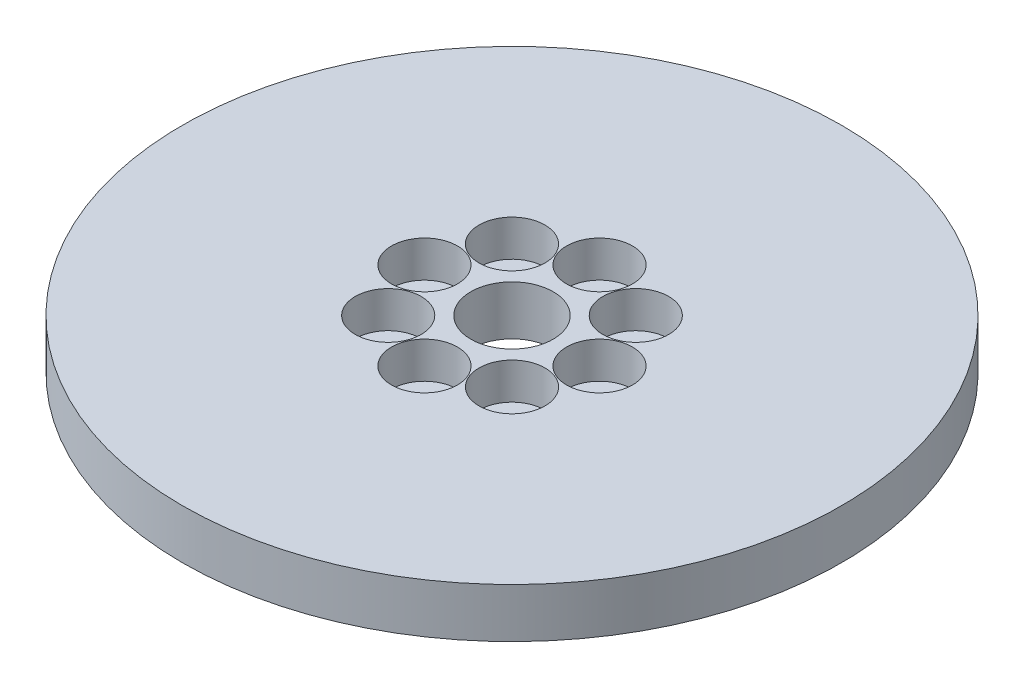
ISO-10303-21;
HEADER;
FILE_DESCRIPTION(('STEP AP214'),'2;1');
FILE_NAME('part.step','',(''),(''),'','','');
FILE_SCHEMA(('AUTOMOTIVE_DESIGN { 1 0 10303 214 1 1 1 1 }'));
ENDSEC;
DATA;
#1=APPLICATION_CONTEXT('core data for automotive mechanical design processes');
#2=APPLICATION_PROTOCOL_DEFINITION('international standard','automotive_design',2000,#1);
#3=PRODUCT_CONTEXT('',#1,'mechanical');
#4=PRODUCT('Part','Part','',(#3));
#5=PRODUCT_RELATED_PRODUCT_CATEGORY('part','',(#4));
#6=PRODUCT_DEFINITION_FORMATION('','',#4);
#7=PRODUCT_DEFINITION_CONTEXT('part definition',#1,'design');
#8=PRODUCT_DEFINITION('design','',#6,#7);
#9=PRODUCT_DEFINITION_SHAPE('','',#8);
#10=(LENGTH_UNIT() NAMED_UNIT(*) SI_UNIT(.MILLI.,.METRE.));
#11=(NAMED_UNIT(*) PLANE_ANGLE_UNIT() SI_UNIT($,.RADIAN.));
#12=(NAMED_UNIT(*) SI_UNIT($,.STERADIAN.) SOLID_ANGLE_UNIT());
#13=UNCERTAINTY_MEASURE_WITH_UNIT(LENGTH_MEASURE(1.E-05),#10,'distance_accuracy_value','');
#14=(GEOMETRIC_REPRESENTATION_CONTEXT(3) GLOBAL_UNCERTAINTY_ASSIGNED_CONTEXT((#13)) GLOBAL_UNIT_ASSIGNED_CONTEXT((#10,
#11,#12)) REPRESENTATION_CONTEXT('',''));
#15=CARTESIAN_POINT('',(0.,0.,0.));
#16=DIRECTION('',(0.,0.,1.));
#17=DIRECTION('',(1.,0.,0.));
#18=AXIS2_PLACEMENT_3D('',#15,#16,#17);
#19=CARTESIAN_POINT('',(0.,15.,0.));
#20=DIRECTION('',(0.,-1.,0.));
#21=DIRECTION('',(0.,0.,-1.));
#22=AXIS2_PLACEMENT_3D('',#19,#20,#21);
#23=CYLINDRICAL_SURFACE('',#22,100.);
#24=CARTESIAN_POINT('',(0.,15.,0.));
#25=DIRECTION('',(0.,1.,0.));
#26=DIRECTION('',(0.,0.,1.));
#27=AXIS2_PLACEMENT_3D('',#24,#25,#26);
#28=CIRCLE('',#27,100.);
#29=CARTESIAN_POINT('',(0.,15.,100.));
#30=VERTEX_POINT('',#29);
#31=EDGE_CURVE('E10',#30,#30,#28,.T.);
#32=ORIENTED_EDGE('',*,*,#31,.F.);
#33=EDGE_LOOP('',(#32));
#34=FACE_BOUND('',#33,.T.);
#35=CARTESIAN_POINT('',(0.,0.,0.));
#36=DIRECTION('',(0.,1.,0.));
#37=DIRECTION('',(0.,0.,1.));
#38=AXIS2_PLACEMENT_3D('',#35,#36,#37);
#39=CIRCLE('',#38,100.);
#40=CARTESIAN_POINT('',(0.,0.,100.));
#41=VERTEX_POINT('',#40);
#42=EDGE_CURVE('E37',#41,#41,#39,.T.);
#43=ORIENTED_EDGE('',*,*,#42,.T.);
#44=EDGE_LOOP('',(#43));
#45=FACE_BOUND('',#44,.T.);
#46=ADVANCED_FACE('F40',(#34,#45),#23,.T.);
#47=CARTESIAN_POINT('',(0.,15.,0.));
#48=DIRECTION('',(0.,1.,0.));
#49=DIRECTION('',(0.,0.,1.));
#50=AXIS2_PLACEMENT_3D('',#47,#48,#49);
#51=PLANE('',#50);
#52=CARTESIAN_POINT('',(26.5604673981069,15.,0.));
#53=DIRECTION('',(0.,1.,0.));
#54=DIRECTION('',(0.,0.,-1.));
#55=AXIS2_PLACEMENT_3D('',#52,#53,#54);
#56=CIRCLE('',#55,10.);
#57=CARTESIAN_POINT('',(26.5604673981069,15.,-10.));
#58=VERTEX_POINT('',#57);
#59=EDGE_CURVE('E78',#58,#58,#56,.T.);
#60=ORIENTED_EDGE('',*,*,#59,.F.);
#61=EDGE_LOOP('',(#60));
#62=FACE_BOUND('',#61,.T.);
#63=CARTESIAN_POINT('',(18.7810866086854,15.,-18.7810866086858));
#64=DIRECTION('',(0.,1.,0.));
#65=DIRECTION('',(-0.707106781186554,0.,-0.707106781186541));
#66=AXIS2_PLACEMENT_3D('',#63,#64,#65);
#67=CIRCLE('',#66,10.);
#68=CARTESIAN_POINT('',(11.7100187968199,15.,-25.8521544205512));
#69=VERTEX_POINT('',#68);
#70=EDGE_CURVE('E84',#69,#69,#67,.T.);
#71=ORIENTED_EDGE('',*,*,#70,.F.);
#72=EDGE_LOOP('',(#71));
#73=FACE_BOUND('',#72,.T.);
#74=CARTESIAN_POINT('',(0.,15.,26.5604673981069));
#75=DIRECTION('',(0.,1.,0.));
#76=DIRECTION('',(1.,0.,0.));
#77=AXIS2_PLACEMENT_3D('',#74,#75,#76);
#78=CIRCLE('',#77,10.);
#79=CARTESIAN_POINT('',(10.0000000000001,15.,26.5604673981069));
#80=VERTEX_POINT('',#79);
#81=EDGE_CURVE('E70',#80,#80,#78,.T.);
#82=ORIENTED_EDGE('',*,*,#81,.F.);
#83=EDGE_LOOP('',(#82));
#84=FACE_BOUND('',#83,.T.);
#85=CARTESIAN_POINT('',(18.7810866086857,15.,18.7810866086855));
#86=DIRECTION('',(0.,1.,0.));
#87=DIRECTION('',(0.707106781186544,0.,-0.707106781186551));
#88=AXIS2_PLACEMENT_3D('',#85,#86,#87);
#89=CIRCLE('',#88,10.);
#90=CARTESIAN_POINT('',(25.8521544205511,15.,11.71001879682));
#91=VERTEX_POINT('',#90);
#92=EDGE_CURVE('E71',#91,#91,#89,.T.);
#93=ORIENTED_EDGE('',*,*,#92,.F.);
#94=EDGE_LOOP('',(#93));
#95=FACE_BOUND('',#94,.T.);
#96=CARTESIAN_POINT('',(-18.7810866086858,15.,-18.7810866086854));
#97=DIRECTION('',(0.,1.,0.));
#98=DIRECTION('',(-0.707106781186539,0.,0.707106781186556));
#99=AXIS2_PLACEMENT_3D('',#96,#97,#98);
#100=CIRCLE('',#99,10.);
#101=CARTESIAN_POINT('',(-25.8521544205512,15.,-11.7100187968198));
#102=VERTEX_POINT('',#101);
#103=EDGE_CURVE('E100',#102,#102,#100,.T.);
#104=ORIENTED_EDGE('',*,*,#103,.F.);
#105=EDGE_LOOP('',(#104));
#106=FACE_BOUND('',#105,.T.);
#107=CARTESIAN_POINT('',(-2.78206128814325E-13,15.,-26.5604673981069));
#108=DIRECTION('',(0.,1.,0.));
#109=DIRECTION('',(-1.,0.,0.));
#110=AXIS2_PLACEMENT_3D('',#107,#108,#109);
#111=CIRCLE('',#110,10.);
#112=CARTESIAN_POINT('',(-10.0000000000003,15.,-26.5604673981068));
#113=VERTEX_POINT('',#112);
#114=EDGE_CURVE('E93',#113,#113,#111,.T.);
#115=ORIENTED_EDGE('',*,*,#114,.F.);
#116=EDGE_LOOP('',(#115));
#117=FACE_BOUND('',#116,.T.);
#118=CARTESIAN_POINT('',(-18.7810866086856,15.,18.7810866086856));
#119=DIRECTION('',(0.,1.,0.));
#120=DIRECTION('',(0.707106781186549,0.,0.707106781186546));
#121=AXIS2_PLACEMENT_3D('',#118,#119,#120);
#122=CIRCLE('',#121,10.);
#123=CARTESIAN_POINT('',(-11.7100187968201,15.,25.8521544205511));
#124=VERTEX_POINT('',#123);
#125=EDGE_CURVE('E61',#124,#124,#122,.T.);
#126=ORIENTED_EDGE('',*,*,#125,.F.);
#127=EDGE_LOOP('',(#126));
#128=FACE_BOUND('',#127,.T.);
#129=CARTESIAN_POINT('',(-26.5604673981069,15.,0.));
#130=DIRECTION('',(0.,1.,0.));
#131=DIRECTION('',(0.,0.,1.));
#132=AXIS2_PLACEMENT_3D('',#129,#130,#131);
#133=CIRCLE('',#132,10.);
#134=CARTESIAN_POINT('',(-26.5604673981069,15.,10.));
#135=VERTEX_POINT('',#134);
#136=EDGE_CURVE('E54',#135,#135,#133,.T.);
#137=ORIENTED_EDGE('',*,*,#136,.F.);
#138=EDGE_LOOP('',(#137));
#139=FACE_BOUND('',#138,.T.);
#140=CARTESIAN_POINT('',(0.,15.,0.));
#141=DIRECTION('',(0.,1.,0.));
#142=DIRECTION('',(0.,0.,1.));
#143=AXIS2_PLACEMENT_3D('',#140,#141,#142);
#144=CIRCLE('',#143,12.5);
#145=CARTESIAN_POINT('',(0.,15.,12.5));
#146=VERTEX_POINT('',#145);
#147=EDGE_CURVE('E50',#146,#146,#144,.T.);
#148=ORIENTED_EDGE('',*,*,#147,.F.);
#149=EDGE_LOOP('',(#148));
#150=FACE_BOUND('',#149,.T.);
#151=ORIENTED_EDGE('',*,*,#31,.T.);
#152=EDGE_LOOP('',(#151));
#153=FACE_BOUND('',#152,.T.);
#154=ADVANCED_FACE('F115',(#62,#73,#84,#95,#106,#117,#128,#139,#150,#153),#51,.T.);
#155=CARTESIAN_POINT('',(0.,0.,0.));
#156=DIRECTION('',(0.,1.,0.));
#157=DIRECTION('',(0.,0.,1.));
#158=AXIS2_PLACEMENT_3D('',#155,#156,#157);
#159=PLANE('',#158);
#160=CARTESIAN_POINT('',(0.,0.,0.));
#161=DIRECTION('',(0.,1.,0.));
#162=DIRECTION('',(0.,0.,1.));
#163=AXIS2_PLACEMENT_3D('',#160,#161,#162);
#164=CIRCLE('',#163,12.5);
#165=CARTESIAN_POINT('',(0.,0.,12.5));
#166=VERTEX_POINT('',#165);
#167=EDGE_CURVE('E47',#166,#166,#164,.T.);
#168=ORIENTED_EDGE('',*,*,#167,.T.);
#169=EDGE_LOOP('',(#168));
#170=FACE_BOUND('',#169,.T.);
#171=ORIENTED_EDGE('',*,*,#42,.F.);
#172=EDGE_LOOP('',(#171));
#173=FACE_BOUND('',#172,.T.);
#174=ADVANCED_FACE('F113',(#170,#173),#159,.F.);
#175=CARTESIAN_POINT('',(0.,15.,0.));
#176=DIRECTION('',(0.,-1.,0.));
#177=DIRECTION('',(0.,0.,-1.));
#178=AXIS2_PLACEMENT_3D('',#175,#176,#177);
#179=CYLINDRICAL_SURFACE('',#178,12.5);
#180=ORIENTED_EDGE('',*,*,#147,.T.);
#181=EDGE_LOOP('',(#180));
#182=FACE_BOUND('',#181,.T.);
#183=ORIENTED_EDGE('',*,*,#167,.F.);
#184=EDGE_LOOP('',(#183));
#185=FACE_BOUND('',#184,.T.);
#186=ADVANCED_FACE('F127',(#182,#185),#179,.F.);
#187=CARTESIAN_POINT('',(-26.5604673981069,3.92732791016097,0.));
#188=DIRECTION('',(0.,1.,0.));
#189=DIRECTION('',(0.,0.,1.));
#190=AXIS2_PLACEMENT_3D('',#187,#188,#189);
#191=CYLINDRICAL_SURFACE('',#190,10.);
#192=CARTESIAN_POINT('',(-26.5604673981069,3.92732791016097,0.));
#193=DIRECTION('',(0.,1.,0.));
#194=DIRECTION('',(0.,0.,1.));
#195=AXIS2_PLACEMENT_3D('',#192,#193,#194);
#196=CIRCLE('',#195,10.);
#197=CARTESIAN_POINT('',(-26.5604673981069,3.92732791016097,10.));
#198=VERTEX_POINT('',#197);
#199=EDGE_CURVE('E55',#198,#198,#196,.T.);
#200=ORIENTED_EDGE('',*,*,#199,.F.);
#201=EDGE_LOOP('',(#200));
#202=FACE_BOUND('',#201,.T.);
#203=ORIENTED_EDGE('',*,*,#136,.T.);
#204=EDGE_LOOP('',(#203));
#205=FACE_BOUND('',#204,.T.);
#206=ADVANCED_FACE('F129',(#202,#205),#191,.F.);
#207=CARTESIAN_POINT('',(-26.5604673981069,3.92732791016097,0.));
#208=DIRECTION('',(0.,1.,0.));
#209=DIRECTION('',(0.,0.,1.));
#210=AXIS2_PLACEMENT_3D('',#207,#208,#209);
#211=PLANE('',#210);
#212=ORIENTED_EDGE('',*,*,#199,.T.);
#213=EDGE_LOOP('',(#212));
#214=FACE_BOUND('',#213,.T.);
#215=ADVANCED_FACE('F157',(#214),#211,.T.);
#216=CARTESIAN_POINT('',(-18.7810866086856,3.92732791016097,18.7810866086856));
#217=DIRECTION('',(0.,1.,0.));
#218=DIRECTION('',(0.,0.,1.));
#219=AXIS2_PLACEMENT_3D('',#216,#217,#218);
#220=CYLINDRICAL_SURFACE('',#219,10.);
#221=CARTESIAN_POINT('',(-18.7810866086856,3.92732791016097,18.7810866086856));
#222=DIRECTION('',(0.,1.,0.));
#223=DIRECTION('',(0.707106781186549,0.,0.707106781186546));
#224=AXIS2_PLACEMENT_3D('',#221,#222,#223);
#225=CIRCLE('',#224,10.);
#226=CARTESIAN_POINT('',(-11.7100187968201,3.92732791016097,25.8521544205511));
#227=VERTEX_POINT('',#226);
#228=EDGE_CURVE('E59',#227,#227,#225,.T.);
#229=ORIENTED_EDGE('',*,*,#228,.F.);
#230=EDGE_LOOP('',(#229));
#231=FACE_BOUND('',#230,.T.);
#232=ORIENTED_EDGE('',*,*,#125,.T.);
#233=EDGE_LOOP('',(#232));
#234=FACE_BOUND('',#233,.T.);
#235=ADVANCED_FACE('F170',(#231,#234),#220,.F.);
#236=CARTESIAN_POINT('',(-18.7810866086856,3.92732791016097,18.7810866086856));
#237=DIRECTION('',(0.,1.,0.));
#238=DIRECTION('',(0.707106781186549,0.,0.707106781186546));
#239=AXIS2_PLACEMENT_3D('',#236,#237,#238);
#240=PLANE('',#239);
#241=ORIENTED_EDGE('',*,*,#228,.T.);
#242=EDGE_LOOP('',(#241));
#243=FACE_BOUND('',#242,.T.);
#244=ADVANCED_FACE('F182',(#243),#240,.T.);
#245=CARTESIAN_POINT('',(-2.78206128814325E-13,3.92732791016097,-26.5604673981069));
#246=DIRECTION('',(0.,1.,0.));
#247=DIRECTION('',(0.,0.,1.));
#248=AXIS2_PLACEMENT_3D('',#245,#246,#247);
#249=CYLINDRICAL_SURFACE('',#248,10.);
#250=CARTESIAN_POINT('',(-2.78206128814325E-13,3.92732791016097,-26.5604673981069));
#251=DIRECTION('',(0.,1.,0.));
#252=DIRECTION('',(-1.,0.,0.));
#253=AXIS2_PLACEMENT_3D('',#250,#251,#252);
#254=CIRCLE('',#253,10.);
#255=CARTESIAN_POINT('',(-10.0000000000003,3.92732791016097,-26.5604673981068));
#256=VERTEX_POINT('',#255);
#257=EDGE_CURVE('E86',#256,#256,#254,.T.);
#258=ORIENTED_EDGE('',*,*,#257,.F.);
#259=EDGE_LOOP('',(#258));
#260=FACE_BOUND('',#259,.T.);
#261=ORIENTED_EDGE('',*,*,#114,.T.);
#262=EDGE_LOOP('',(#261));
#263=FACE_BOUND('',#262,.T.);
#264=ADVANCED_FACE('F189',(#260,#263),#249,.F.);
#265=CARTESIAN_POINT('',(-2.78206128814325E-13,3.92732791016097,-26.5604673981069));
#266=DIRECTION('',(0.,1.,0.));
#267=DIRECTION('',(-1.,0.,0.));
#268=AXIS2_PLACEMENT_3D('',#265,#266,#267);
#269=PLANE('',#268);
#270=ORIENTED_EDGE('',*,*,#257,.T.);
#271=EDGE_LOOP('',(#270));
#272=FACE_BOUND('',#271,.T.);
#273=ADVANCED_FACE('F107',(#272),#269,.T.);
#274=CARTESIAN_POINT('',(-18.7810866086858,3.92732791016097,-18.7810866086854));
#275=DIRECTION('',(0.,1.,0.));
#276=DIRECTION('',(0.,0.,1.));
#277=AXIS2_PLACEMENT_3D('',#274,#275,#276);
#278=CYLINDRICAL_SURFACE('',#277,10.);
#279=CARTESIAN_POINT('',(-18.7810866086858,3.92732791016097,-18.7810866086854));
#280=DIRECTION('',(0.,1.,0.));
#281=DIRECTION('',(-0.707106781186539,0.,0.707106781186556));
#282=AXIS2_PLACEMENT_3D('',#279,#280,#281);
#283=CIRCLE('',#282,10.);
#284=CARTESIAN_POINT('',(-25.8521544205512,3.92732791016097,-11.7100187968198));
#285=VERTEX_POINT('',#284);
#286=EDGE_CURVE('E94',#285,#285,#283,.T.);
#287=ORIENTED_EDGE('',*,*,#286,.F.);
#288=EDGE_LOOP('',(#287));
#289=FACE_BOUND('',#288,.T.);
#290=ORIENTED_EDGE('',*,*,#103,.T.);
#291=EDGE_LOOP('',(#290));
#292=FACE_BOUND('',#291,.T.);
#293=ADVANCED_FACE('F104',(#289,#292),#278,.F.);
#294=CARTESIAN_POINT('',(-18.7810866086858,3.92732791016097,-18.7810866086854));
#295=DIRECTION('',(0.,1.,0.));
#296=DIRECTION('',(-0.707106781186539,0.,0.707106781186556));
#297=AXIS2_PLACEMENT_3D('',#294,#295,#296);
#298=PLANE('',#297);
#299=ORIENTED_EDGE('',*,*,#286,.T.);
#300=EDGE_LOOP('',(#299));
#301=FACE_BOUND('',#300,.T.);
#302=ADVANCED_FACE('F103',(#301),#298,.T.);
#303=CARTESIAN_POINT('',(18.7810866086857,3.92732791016097,18.7810866086855));
#304=DIRECTION('',(0.,1.,0.));
#305=DIRECTION('',(0.,0.,1.));
#306=AXIS2_PLACEMENT_3D('',#303,#304,#305);
#307=CYLINDRICAL_SURFACE('',#306,10.);
#308=CARTESIAN_POINT('',(18.7810866086857,3.92732791016097,18.7810866086855));
#309=DIRECTION('',(0.,1.,0.));
#310=DIRECTION('',(0.707106781186544,0.,-0.707106781186551));
#311=AXIS2_PLACEMENT_3D('',#308,#309,#310);
#312=CIRCLE('',#311,10.);
#313=CARTESIAN_POINT('',(25.8521544205511,3.92732791016097,11.71001879682));
#314=VERTEX_POINT('',#313);
#315=EDGE_CURVE('E69',#314,#314,#312,.T.);
#316=ORIENTED_EDGE('',*,*,#315,.F.);
#317=EDGE_LOOP('',(#316));
#318=FACE_BOUND('',#317,.T.);
#319=ORIENTED_EDGE('',*,*,#92,.T.);
#320=EDGE_LOOP('',(#319));
#321=FACE_BOUND('',#320,.T.);
#322=ADVANCED_FACE('F219',(#318,#321),#307,.F.);
#323=CARTESIAN_POINT('',(18.7810866086857,3.92732791016097,18.7810866086855));
#324=DIRECTION('',(0.,1.,0.));
#325=DIRECTION('',(0.707106781186544,0.,-0.707106781186551));
#326=AXIS2_PLACEMENT_3D('',#323,#324,#325);
#327=PLANE('',#326);
#328=ORIENTED_EDGE('',*,*,#315,.T.);
#329=EDGE_LOOP('',(#328));
#330=FACE_BOUND('',#329,.T.);
#331=ADVANCED_FACE('F227',(#330),#327,.T.);
#332=CARTESIAN_POINT('',(0.,3.92732791016097,26.5604673981069));
#333=DIRECTION('',(0.,1.,0.));
#334=DIRECTION('',(0.,0.,1.));
#335=AXIS2_PLACEMENT_3D('',#332,#333,#334);
#336=CYLINDRICAL_SURFACE('',#335,10.);
#337=CARTESIAN_POINT('',(0.,3.92732791016097,26.5604673981069));
#338=DIRECTION('',(0.,1.,0.));
#339=DIRECTION('',(1.,0.,0.));
#340=AXIS2_PLACEMENT_3D('',#337,#338,#339);
#341=CIRCLE('',#340,10.);
#342=CARTESIAN_POINT('',(10.0000000000001,3.92732791016097,26.5604673981069));
#343=VERTEX_POINT('',#342);
#344=EDGE_CURVE('E63',#343,#343,#341,.T.);
#345=ORIENTED_EDGE('',*,*,#344,.F.);
#346=EDGE_LOOP('',(#345));
#347=FACE_BOUND('',#346,.T.);
#348=ORIENTED_EDGE('',*,*,#81,.T.);
#349=EDGE_LOOP('',(#348));
#350=FACE_BOUND('',#349,.T.);
#351=ADVANCED_FACE('F240',(#347,#350),#336,.F.);
#352=CARTESIAN_POINT('',(0.,3.92732791016097,26.5604673981069));
#353=DIRECTION('',(0.,1.,0.));
#354=DIRECTION('',(1.,0.,0.));
#355=AXIS2_PLACEMENT_3D('',#352,#353,#354);
#356=PLANE('',#355);
#357=ORIENTED_EDGE('',*,*,#344,.T.);
#358=EDGE_LOOP('',(#357));
#359=FACE_BOUND('',#358,.T.);
#360=ADVANCED_FACE('F246',(#359),#356,.T.);
#361=CARTESIAN_POINT('',(18.7810866086854,3.92732791016097,-18.7810866086858));
#362=DIRECTION('',(0.,1.,0.));
#363=DIRECTION('',(0.,0.,1.));
#364=AXIS2_PLACEMENT_3D('',#361,#362,#363);
#365=CYLINDRICAL_SURFACE('',#364,10.);
#366=CARTESIAN_POINT('',(18.7810866086854,3.92732791016097,-18.7810866086858));
#367=DIRECTION('',(0.,1.,0.));
#368=DIRECTION('',(-0.707106781186554,0.,-0.707106781186541));
#369=AXIS2_PLACEMENT_3D('',#366,#367,#368);
#370=CIRCLE('',#369,10.);
#371=CARTESIAN_POINT('',(11.7100187968199,3.92732791016097,-25.8521544205512));
#372=VERTEX_POINT('',#371);
#373=EDGE_CURVE('E85',#372,#372,#370,.T.);
#374=ORIENTED_EDGE('',*,*,#373,.F.);
#375=EDGE_LOOP('',(#374));
#376=FACE_BOUND('',#375,.T.);
#377=ORIENTED_EDGE('',*,*,#70,.T.);
#378=EDGE_LOOP('',(#377));
#379=FACE_BOUND('',#378,.T.);
#380=ADVANCED_FACE('F254',(#376,#379),#365,.F.);
#381=CARTESIAN_POINT('',(18.7810866086854,3.92732791016097,-18.7810866086858));
#382=DIRECTION('',(0.,1.,0.));
#383=DIRECTION('',(-0.707106781186554,0.,-0.707106781186541));
#384=AXIS2_PLACEMENT_3D('',#381,#382,#383);
#385=PLANE('',#384);
#386=ORIENTED_EDGE('',*,*,#373,.T.);
#387=EDGE_LOOP('',(#386));
#388=FACE_BOUND('',#387,.T.);
#389=ADVANCED_FACE('F262',(#388),#385,.T.);
#390=CARTESIAN_POINT('',(26.5604673981069,3.92732791016097,0.));
#391=DIRECTION('',(0.,1.,0.));
#392=DIRECTION('',(0.,0.,1.));
#393=AXIS2_PLACEMENT_3D('',#390,#391,#392);
#394=CYLINDRICAL_SURFACE('',#393,10.);
#395=CARTESIAN_POINT('',(26.5604673981069,3.92732791016097,0.));
#396=DIRECTION('',(0.,1.,0.));
#397=DIRECTION('',(0.,0.,-1.));
#398=AXIS2_PLACEMENT_3D('',#395,#396,#397);
#399=CIRCLE('',#398,10.);
#400=CARTESIAN_POINT('',(26.5604673981069,3.92732791016097,-10.));
#401=VERTEX_POINT('',#400);
#402=EDGE_CURVE('E76',#401,#401,#399,.T.);
#403=ORIENTED_EDGE('',*,*,#402,.F.);
#404=EDGE_LOOP('',(#403));
#405=FACE_BOUND('',#404,.T.);
#406=ORIENTED_EDGE('',*,*,#59,.T.);
#407=EDGE_LOOP('',(#406));
#408=FACE_BOUND('',#407,.T.);
#409=ADVANCED_FACE('F272',(#405,#408),#394,.F.);
#410=CARTESIAN_POINT('',(26.5604673981069,3.92732791016097,0.));
#411=DIRECTION('',(0.,1.,0.));
#412=DIRECTION('',(0.,0.,-1.));
#413=AXIS2_PLACEMENT_3D('',#410,#411,#412);
#414=PLANE('',#413);
#415=ORIENTED_EDGE('',*,*,#402,.T.);
#416=EDGE_LOOP('',(#415));
#417=FACE_BOUND('',#416,.T.);
#418=ADVANCED_FACE('F285',(#417),#414,.T.);
#419=CLOSED_SHELL('',(#46,#154,#174,#186,#206,#215,#235,#244,#264,#273,#293,#302,#322,#331,#351,
#360,#380,#389,#409,#418));
#420=MANIFOLD_SOLID_BREP('B2',#419);
#421=ADVANCED_BREP_SHAPE_REPRESENTATION('',(#18,#420),#14);
#422=SHAPE_DEFINITION_REPRESENTATION(#9,#421);
ENDSEC;
END-ISO-10303-21;
